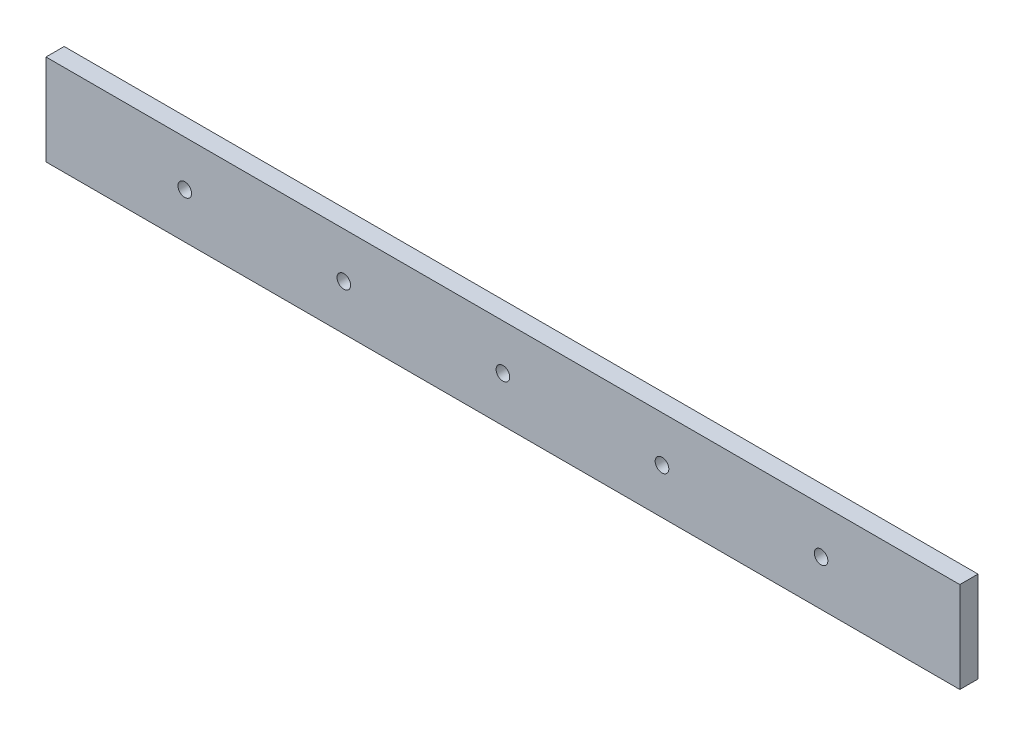
ISO-10303-21;
HEADER;
FILE_DESCRIPTION(('STEP AP214'),'2;1');
FILE_NAME('part.step','',(''),(''),'','','');
FILE_SCHEMA(('AUTOMOTIVE_DESIGN { 1 0 10303 214 1 1 1 1 }'));
ENDSEC;
DATA;
#1=APPLICATION_CONTEXT('core data for automotive mechanical design processes');
#2=APPLICATION_PROTOCOL_DEFINITION('international standard','automotive_design',2000,#1);
#3=PRODUCT_CONTEXT('',#1,'mechanical');
#4=PRODUCT('Part','Part','',(#3));
#5=PRODUCT_RELATED_PRODUCT_CATEGORY('part','',(#4));
#6=PRODUCT_DEFINITION_FORMATION('','',#4);
#7=PRODUCT_DEFINITION_CONTEXT('part definition',#1,'design');
#8=PRODUCT_DEFINITION('design','',#6,#7);
#9=PRODUCT_DEFINITION_SHAPE('','',#8);
#10=(LENGTH_UNIT() NAMED_UNIT(*) SI_UNIT(.MILLI.,.METRE.));
#11=(NAMED_UNIT(*) PLANE_ANGLE_UNIT() SI_UNIT($,.RADIAN.));
#12=(NAMED_UNIT(*) SI_UNIT($,.STERADIAN.) SOLID_ANGLE_UNIT());
#13=UNCERTAINTY_MEASURE_WITH_UNIT(LENGTH_MEASURE(1.E-05),#10,'distance_accuracy_value','');
#14=(GEOMETRIC_REPRESENTATION_CONTEXT(3) GLOBAL_UNCERTAINTY_ASSIGNED_CONTEXT((#13)) GLOBAL_UNIT_ASSIGNED_CONTEXT((#10,
#11,#12)) REPRESENTATION_CONTEXT('',''));
#15=CARTESIAN_POINT('',(0.,0.,0.));
#16=DIRECTION('',(0.,0.,1.));
#17=DIRECTION('',(1.,0.,0.));
#18=AXIS2_PLACEMENT_3D('',#15,#16,#17);
#19=CARTESIAN_POINT('',(100.53,20.,-2.));
#20=DIRECTION('',(-1.,0.,0.));
#21=DIRECTION('',(0.,0.,1.));
#22=AXIS2_PLACEMENT_3D('',#19,#20,#21);
#23=PLANE('',#22);
#24=DIRECTION('',(0.,0.,-1.));
#25=VECTOR('',#24,1.);
#26=CARTESIAN_POINT('',(100.53,0.,-2.));
#27=LINE('',#26,#25);
#28=CARTESIAN_POINT('',(100.53,0.,2.));
#29=VERTEX_POINT('',#28);
#30=CARTESIAN_POINT('',(100.53,0.,-2.));
#31=VERTEX_POINT('',#30);
#32=EDGE_CURVE('E99',#29,#31,#27,.T.);
#33=ORIENTED_EDGE('',*,*,#32,.T.);
#34=DIRECTION('',(0.,-1.,0.));
#35=VECTOR('',#34,1.);
#36=CARTESIAN_POINT('',(100.53,20.,-2.));
#37=LINE('',#36,#35);
#38=CARTESIAN_POINT('',(100.53,20.,-2.));
#39=VERTEX_POINT('',#38);
#40=EDGE_CURVE('E11',#39,#31,#37,.T.);
#41=ORIENTED_EDGE('',*,*,#40,.F.);
#42=DIRECTION('',(0.,0.,-1.));
#43=VECTOR('',#42,1.);
#44=CARTESIAN_POINT('',(100.53,20.,-2.));
#45=LINE('',#44,#43);
#46=CARTESIAN_POINT('',(100.53,20.,2.));
#47=VERTEX_POINT('',#46);
#48=EDGE_CURVE('E86',#47,#39,#45,.T.);
#49=ORIENTED_EDGE('',*,*,#48,.F.);
#50=DIRECTION('',(0.,-1.,0.));
#51=VECTOR('',#50,1.);
#52=CARTESIAN_POINT('',(100.53,20.,2.));
#53=LINE('',#52,#51);
#54=EDGE_CURVE('E95',#47,#29,#53,.T.);
#55=ORIENTED_EDGE('',*,*,#54,.T.);
#56=EDGE_LOOP('',(#33,#41,#49,#55));
#57=FACE_BOUND('',#56,.T.);
#58=ADVANCED_FACE('F33',(#57),#23,.F.);
#59=CARTESIAN_POINT('',(-100.53,20.,-2.));
#60=DIRECTION('',(0.,0.,1.));
#61=DIRECTION('',(1.,0.,0.));
#62=AXIS2_PLACEMENT_3D('',#59,#60,#61);
#63=PLANE('',#62);
#64=CARTESIAN_POINT('',(-69.9999999999999,10.,-2.));
#65=DIRECTION('',(0.,0.,1.));
#66=DIRECTION('',(1.,0.,0.));
#67=AXIS2_PLACEMENT_3D('',#64,#65,#66);
#68=CIRCLE('',#67,1.5);
#69=CARTESIAN_POINT('',(-68.4999999999999,10.,-2.));
#70=VERTEX_POINT('',#69);
#71=EDGE_CURVE('E111',#70,#70,#68,.T.);
#72=ORIENTED_EDGE('',*,*,#71,.T.);
#73=EDGE_LOOP('',(#72));
#74=FACE_BOUND('',#73,.T.);
#75=CARTESIAN_POINT('',(-34.9999999999999,10.,-2.));
#76=DIRECTION('',(0.,0.,1.));
#77=DIRECTION('',(1.,0.,0.));
#78=AXIS2_PLACEMENT_3D('',#75,#76,#77);
#79=CIRCLE('',#78,1.5);
#80=CARTESIAN_POINT('',(-33.4999999999999,10.,-2.));
#81=VERTEX_POINT('',#80);
#82=EDGE_CURVE('E240',#81,#81,#79,.T.);
#83=ORIENTED_EDGE('',*,*,#82,.T.);
#84=EDGE_LOOP('',(#83));
#85=FACE_BOUND('',#84,.T.);
#86=CARTESIAN_POINT('',(0.,10.,-2.));
#87=DIRECTION('',(0.,0.,1.));
#88=DIRECTION('',(1.,0.,0.));
#89=AXIS2_PLACEMENT_3D('',#86,#87,#88);
#90=CIRCLE('',#89,1.5);
#91=CARTESIAN_POINT('',(1.50000000000005,10.,-2.));
#92=VERTEX_POINT('',#91);
#93=EDGE_CURVE('E230',#92,#92,#90,.T.);
#94=ORIENTED_EDGE('',*,*,#93,.T.);
#95=EDGE_LOOP('',(#94));
#96=FACE_BOUND('',#95,.T.);
#97=CARTESIAN_POINT('',(35.,10.,-2.));
#98=DIRECTION('',(0.,0.,1.));
#99=DIRECTION('',(1.,0.,0.));
#100=AXIS2_PLACEMENT_3D('',#97,#98,#99);
#101=CIRCLE('',#100,1.5);
#102=CARTESIAN_POINT('',(36.5,10.,-2.));
#103=VERTEX_POINT('',#102);
#104=EDGE_CURVE('E241',#103,#103,#101,.T.);
#105=ORIENTED_EDGE('',*,*,#104,.T.);
#106=EDGE_LOOP('',(#105));
#107=FACE_BOUND('',#106,.T.);
#108=CARTESIAN_POINT('',(70.,10.,-2.));
#109=DIRECTION('',(0.,0.,1.));
#110=DIRECTION('',(1.,0.,0.));
#111=AXIS2_PLACEMENT_3D('',#108,#109,#110);
#112=CIRCLE('',#111,1.5);
#113=CARTESIAN_POINT('',(71.5,10.,-2.));
#114=VERTEX_POINT('',#113);
#115=EDGE_CURVE('E246',#114,#114,#112,.T.);
#116=ORIENTED_EDGE('',*,*,#115,.T.);
#117=EDGE_LOOP('',(#116));
#118=FACE_BOUND('',#117,.T.);
#119=DIRECTION('',(-1.,0.,0.));
#120=VECTOR('',#119,1.);
#121=CARTESIAN_POINT('',(-100.53,0.,-2.));
#122=LINE('',#121,#120);
#123=CARTESIAN_POINT('',(-100.53,0.,-2.));
#124=VERTEX_POINT('',#123);
#125=EDGE_CURVE('E90',#31,#124,#122,.T.);
#126=ORIENTED_EDGE('',*,*,#125,.T.);
#127=DIRECTION('',(0.,-1.,0.));
#128=VECTOR('',#127,1.);
#129=CARTESIAN_POINT('',(-100.53,20.,-2.));
#130=LINE('',#129,#128);
#131=CARTESIAN_POINT('',(-100.53,20.,-2.));
#132=VERTEX_POINT('',#131);
#133=EDGE_CURVE('E42',#132,#124,#130,.T.);
#134=ORIENTED_EDGE('',*,*,#133,.F.);
#135=DIRECTION('',(-1.,0.,0.));
#136=VECTOR('',#135,1.);
#137=CARTESIAN_POINT('',(-100.53,20.,-2.));
#138=LINE('',#137,#136);
#139=EDGE_CURVE('E81',#39,#132,#138,.T.);
#140=ORIENTED_EDGE('',*,*,#139,.F.);
#141=ORIENTED_EDGE('',*,*,#40,.T.);
#142=EDGE_LOOP('',(#126,#134,#140,#141));
#143=FACE_BOUND('',#142,.T.);
#144=ADVANCED_FACE('F89',(#74,#85,#96,#107,#118,#143),#63,.F.);
#145=CARTESIAN_POINT('',(-100.53,20.,-2.));
#146=DIRECTION('',(1.,0.,0.));
#147=DIRECTION('',(0.,0.,-1.));
#148=AXIS2_PLACEMENT_3D('',#145,#146,#147);
#149=PLANE('',#148);
#150=DIRECTION('',(0.,0.,1.));
#151=VECTOR('',#150,1.);
#152=CARTESIAN_POINT('',(-100.53,0.,-2.));
#153=LINE('',#152,#151);
#154=CARTESIAN_POINT('',(-100.53,0.,2.));
#155=VERTEX_POINT('',#154);
#156=EDGE_CURVE('E68',#124,#155,#153,.T.);
#157=ORIENTED_EDGE('',*,*,#156,.T.);
#158=DIRECTION('',(0.,-1.,0.));
#159=VECTOR('',#158,1.);
#160=CARTESIAN_POINT('',(-100.53,20.,2.));
#161=LINE('',#160,#159);
#162=CARTESIAN_POINT('',(-100.53,20.,2.));
#163=VERTEX_POINT('',#162);
#164=EDGE_CURVE('E91',#163,#155,#161,.T.);
#165=ORIENTED_EDGE('',*,*,#164,.F.);
#166=DIRECTION('',(0.,0.,1.));
#167=VECTOR('',#166,1.);
#168=CARTESIAN_POINT('',(-100.53,20.,-2.));
#169=LINE('',#168,#167);
#170=EDGE_CURVE('E84',#132,#163,#169,.T.);
#171=ORIENTED_EDGE('',*,*,#170,.F.);
#172=ORIENTED_EDGE('',*,*,#133,.T.);
#173=EDGE_LOOP('',(#157,#165,#171,#172));
#174=FACE_BOUND('',#173,.T.);
#175=ADVANCED_FACE('F93',(#174),#149,.F.);
#176=CARTESIAN_POINT('',(-100.53,20.,2.));
#177=DIRECTION('',(0.,0.,-1.));
#178=DIRECTION('',(-1.,0.,0.));
#179=AXIS2_PLACEMENT_3D('',#176,#177,#178);
#180=PLANE('',#179);
#181=CARTESIAN_POINT('',(-69.9999999999999,10.,2.));
#182=DIRECTION('',(0.,0.,-1.));
#183=DIRECTION('',(-1.,0.,0.));
#184=AXIS2_PLACEMENT_3D('',#181,#182,#183);
#185=CIRCLE('',#184,1.5);
#186=CARTESIAN_POINT('',(-71.4999999999999,10.,2.));
#187=VERTEX_POINT('',#186);
#188=EDGE_CURVE('E36',#187,#187,#185,.T.);
#189=ORIENTED_EDGE('',*,*,#188,.T.);
#190=EDGE_LOOP('',(#189));
#191=FACE_BOUND('',#190,.T.);
#192=CARTESIAN_POINT('',(-34.9999999999999,10.,2.));
#193=DIRECTION('',(0.,0.,-1.));
#194=DIRECTION('',(-1.,0.,0.));
#195=AXIS2_PLACEMENT_3D('',#192,#193,#194);
#196=CIRCLE('',#195,1.5);
#197=CARTESIAN_POINT('',(-36.4999999999999,10.,2.));
#198=VERTEX_POINT('',#197);
#199=EDGE_CURVE('E116',#198,#198,#196,.T.);
#200=ORIENTED_EDGE('',*,*,#199,.T.);
#201=EDGE_LOOP('',(#200));
#202=FACE_BOUND('',#201,.T.);
#203=CARTESIAN_POINT('',(0.,10.,2.));
#204=DIRECTION('',(0.,0.,-1.));
#205=DIRECTION('',(-1.,0.,0.));
#206=AXIS2_PLACEMENT_3D('',#203,#204,#205);
#207=CIRCLE('',#206,1.5);
#208=CARTESIAN_POINT('',(-1.49999999999994,10.,2.));
#209=VERTEX_POINT('',#208);
#210=EDGE_CURVE('E114',#209,#209,#207,.T.);
#211=ORIENTED_EDGE('',*,*,#210,.T.);
#212=EDGE_LOOP('',(#211));
#213=FACE_BOUND('',#212,.T.);
#214=CARTESIAN_POINT('',(35.,10.,2.));
#215=DIRECTION('',(0.,0.,-1.));
#216=DIRECTION('',(-1.,0.,0.));
#217=AXIS2_PLACEMENT_3D('',#214,#215,#216);
#218=CIRCLE('',#217,1.5);
#219=CARTESIAN_POINT('',(33.5,10.,2.));
#220=VERTEX_POINT('',#219);
#221=EDGE_CURVE('E110',#220,#220,#218,.T.);
#222=ORIENTED_EDGE('',*,*,#221,.T.);
#223=EDGE_LOOP('',(#222));
#224=FACE_BOUND('',#223,.T.);
#225=CARTESIAN_POINT('',(70.,10.,2.));
#226=DIRECTION('',(0.,0.,-1.));
#227=DIRECTION('',(-1.,0.,0.));
#228=AXIS2_PLACEMENT_3D('',#225,#226,#227);
#229=CIRCLE('',#228,1.5);
#230=CARTESIAN_POINT('',(68.5,10.,2.));
#231=VERTEX_POINT('',#230);
#232=EDGE_CURVE('E107',#231,#231,#229,.T.);
#233=ORIENTED_EDGE('',*,*,#232,.T.);
#234=EDGE_LOOP('',(#233));
#235=FACE_BOUND('',#234,.T.);
#236=DIRECTION('',(1.,0.,0.));
#237=VECTOR('',#236,1.);
#238=CARTESIAN_POINT('',(-100.53,0.,2.));
#239=LINE('',#238,#237);
#240=EDGE_CURVE('E74',#155,#29,#239,.T.);
#241=ORIENTED_EDGE('',*,*,#240,.T.);
#242=ORIENTED_EDGE('',*,*,#54,.F.);
#243=DIRECTION('',(1.,0.,0.));
#244=VECTOR('',#243,1.);
#245=CARTESIAN_POINT('',(-100.53,20.,2.));
#246=LINE('',#245,#244);
#247=EDGE_CURVE('E51',#163,#47,#246,.T.);
#248=ORIENTED_EDGE('',*,*,#247,.F.);
#249=ORIENTED_EDGE('',*,*,#164,.T.);
#250=EDGE_LOOP('',(#241,#242,#248,#249));
#251=FACE_BOUND('',#250,.T.);
#252=ADVANCED_FACE('F123',(#191,#202,#213,#224,#235,#251),#180,.F.);
#253=CARTESIAN_POINT('',(0.,20.,0.));
#254=DIRECTION('',(0.,1.,0.));
#255=DIRECTION('',(0.,0.,1.));
#256=AXIS2_PLACEMENT_3D('',#253,#254,#255);
#257=PLANE('',#256);
#258=ORIENTED_EDGE('',*,*,#48,.T.);
#259=ORIENTED_EDGE('',*,*,#139,.T.);
#260=ORIENTED_EDGE('',*,*,#170,.T.);
#261=ORIENTED_EDGE('',*,*,#247,.T.);
#262=EDGE_LOOP('',(#258,#259,#260,#261));
#263=FACE_BOUND('',#262,.T.);
#264=ADVANCED_FACE('F82',(#263),#257,.T.);
#265=CARTESIAN_POINT('',(0.,0.,0.));
#266=DIRECTION('',(0.,1.,0.));
#267=DIRECTION('',(0.,0.,1.));
#268=AXIS2_PLACEMENT_3D('',#265,#266,#267);
#269=PLANE('',#268);
#270=ORIENTED_EDGE('',*,*,#32,.F.);
#271=ORIENTED_EDGE('',*,*,#240,.F.);
#272=ORIENTED_EDGE('',*,*,#156,.F.);
#273=ORIENTED_EDGE('',*,*,#125,.F.);
#274=EDGE_LOOP('',(#270,#271,#272,#273));
#275=FACE_BOUND('',#274,.T.);
#276=ADVANCED_FACE('F145',(#275),#269,.F.);
#277=CARTESIAN_POINT('',(70.,10.,-2.));
#278=DIRECTION('',(0.,0.,1.));
#279=DIRECTION('',(1.,0.,0.));
#280=AXIS2_PLACEMENT_3D('',#277,#278,#279);
#281=CYLINDRICAL_SURFACE('',#280,1.5);
#282=ORIENTED_EDGE('',*,*,#115,.F.);
#283=EDGE_LOOP('',(#282));
#284=FACE_BOUND('',#283,.T.);
#285=ORIENTED_EDGE('',*,*,#232,.F.);
#286=EDGE_LOOP('',(#285));
#287=FACE_BOUND('',#286,.T.);
#288=ADVANCED_FACE('F147',(#284,#287),#281,.F.);
#289=CARTESIAN_POINT('',(35.,10.,-2.));
#290=DIRECTION('',(0.,0.,1.));
#291=DIRECTION('',(1.,0.,0.));
#292=AXIS2_PLACEMENT_3D('',#289,#290,#291);
#293=CYLINDRICAL_SURFACE('',#292,1.5);
#294=ORIENTED_EDGE('',*,*,#104,.F.);
#295=EDGE_LOOP('',(#294));
#296=FACE_BOUND('',#295,.T.);
#297=ORIENTED_EDGE('',*,*,#221,.F.);
#298=EDGE_LOOP('',(#297));
#299=FACE_BOUND('',#298,.T.);
#300=ADVANCED_FACE('F153',(#296,#299),#293,.F.);
#301=CARTESIAN_POINT('',(0.,10.,-2.));
#302=DIRECTION('',(0.,0.,1.));
#303=DIRECTION('',(1.,0.,0.));
#304=AXIS2_PLACEMENT_3D('',#301,#302,#303);
#305=CYLINDRICAL_SURFACE('',#304,1.5);
#306=ORIENTED_EDGE('',*,*,#93,.F.);
#307=EDGE_LOOP('',(#306));
#308=FACE_BOUND('',#307,.T.);
#309=ORIENTED_EDGE('',*,*,#210,.F.);
#310=EDGE_LOOP('',(#309));
#311=FACE_BOUND('',#310,.T.);
#312=ADVANCED_FACE('F133',(#308,#311),#305,.F.);
#313=CARTESIAN_POINT('',(-34.9999999999999,10.,-2.));
#314=DIRECTION('',(0.,0.,1.));
#315=DIRECTION('',(1.,0.,0.));
#316=AXIS2_PLACEMENT_3D('',#313,#314,#315);
#317=CYLINDRICAL_SURFACE('',#316,1.5);
#318=ORIENTED_EDGE('',*,*,#82,.F.);
#319=EDGE_LOOP('',(#318));
#320=FACE_BOUND('',#319,.T.);
#321=ORIENTED_EDGE('',*,*,#199,.F.);
#322=EDGE_LOOP('',(#321));
#323=FACE_BOUND('',#322,.T.);
#324=ADVANCED_FACE('F127',(#320,#323),#317,.F.);
#325=CARTESIAN_POINT('',(-69.9999999999999,10.,-2.));
#326=DIRECTION('',(0.,0.,1.));
#327=DIRECTION('',(1.,0.,0.));
#328=AXIS2_PLACEMENT_3D('',#325,#326,#327);
#329=CYLINDRICAL_SURFACE('',#328,1.5);
#330=ORIENTED_EDGE('',*,*,#71,.F.);
#331=EDGE_LOOP('',(#330));
#332=FACE_BOUND('',#331,.T.);
#333=ORIENTED_EDGE('',*,*,#188,.F.);
#334=EDGE_LOOP('',(#333));
#335=FACE_BOUND('',#334,.T.);
#336=ADVANCED_FACE('F125',(#332,#335),#329,.F.);
#337=CLOSED_SHELL('',(#58,#144,#175,#252,#264,#276,#288,#300,#312,#324,#336));
#338=MANIFOLD_SOLID_BREP('B2',#337);
#339=ADVANCED_BREP_SHAPE_REPRESENTATION('',(#18,#338),#14);
#340=SHAPE_DEFINITION_REPRESENTATION(#9,#339);
ENDSEC;
END-ISO-10303-21;
